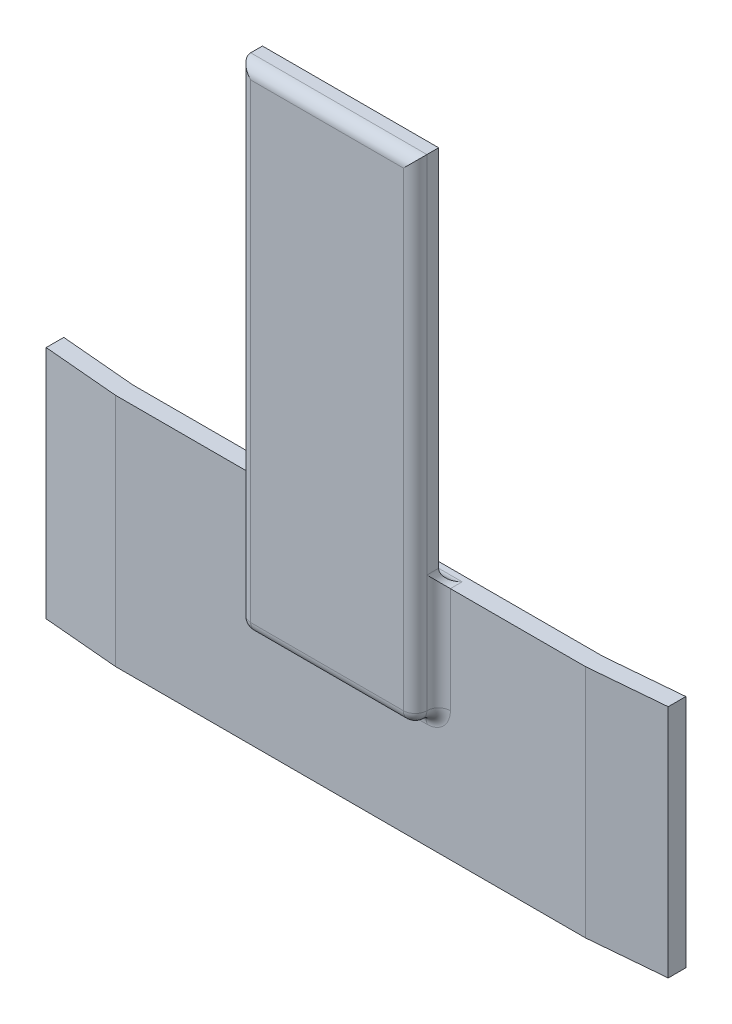
ISO-10303-21;
HEADER;
FILE_DESCRIPTION(('STEP AP214'),'2;1');
FILE_NAME('part.step','',(''),(''),'','','');
FILE_SCHEMA(('AUTOMOTIVE_DESIGN { 1 0 10303 214 1 1 1 1 }'));
ENDSEC;
DATA;
#1=APPLICATION_CONTEXT('core data for automotive mechanical design processes');
#2=APPLICATION_PROTOCOL_DEFINITION('international standard','automotive_design',2000,#1);
#3=PRODUCT_CONTEXT('',#1,'mechanical');
#4=PRODUCT('Part','Part','',(#3));
#5=PRODUCT_RELATED_PRODUCT_CATEGORY('part','',(#4));
#6=PRODUCT_DEFINITION_FORMATION('','',#4);
#7=PRODUCT_DEFINITION_CONTEXT('part definition',#1,'design');
#8=PRODUCT_DEFINITION('design','',#6,#7);
#9=PRODUCT_DEFINITION_SHAPE('','',#8);
#10=(LENGTH_UNIT() NAMED_UNIT(*) SI_UNIT(.MILLI.,.METRE.));
#11=(NAMED_UNIT(*) PLANE_ANGLE_UNIT() SI_UNIT($,.RADIAN.));
#12=(NAMED_UNIT(*) SI_UNIT($,.STERADIAN.) SOLID_ANGLE_UNIT());
#13=UNCERTAINTY_MEASURE_WITH_UNIT(LENGTH_MEASURE(1.E-05),#10,'distance_accuracy_value','');
#14=(GEOMETRIC_REPRESENTATION_CONTEXT(3) GLOBAL_UNCERTAINTY_ASSIGNED_CONTEXT((#13)) GLOBAL_UNIT_ASSIGNED_CONTEXT((#10,
#11,#12)) REPRESENTATION_CONTEXT('',''));
#15=CARTESIAN_POINT('',(0.,0.,0.));
#16=DIRECTION('',(0.,0.,1.));
#17=DIRECTION('',(1.,0.,0.));
#18=AXIS2_PLACEMENT_3D('',#15,#16,#17);
#19=CARTESIAN_POINT('',(0.,0.,3.81));
#20=DIRECTION('',(0.,0.,-1.));
#21=DIRECTION('',(-1.,0.,0.));
#22=AXIS2_PLACEMENT_3D('',#19,#20,#21);
#23=PLANE('',#22);
#24=CARTESIAN_POINT('',(-16.51,2.54,3.81));
#25=DIRECTION('',(0.,0.,-1.));
#26=DIRECTION('',(-1.,0.,0.));
#27=AXIS2_PLACEMENT_3D('',#24,#25,#26);
#28=CIRCLE('',#27,5.08);
#29=CARTESIAN_POINT('',(-21.59,2.54,3.81));
#30=VERTEX_POINT('',#29);
#31=CARTESIAN_POINT('',(-16.51,-2.54,3.81));
#32=VERTEX_POINT('',#31);
#33=EDGE_CURVE('E259',#30,#32,#28,.F.);
#34=ORIENTED_EDGE('',*,*,#33,.F.);
#35=DIRECTION('',(0.,-1.,0.));
#36=VECTOR('',#35,1.);
#37=CARTESIAN_POINT('',(-21.59,25.4,3.81));
#38=LINE('',#37,#36);
#39=CARTESIAN_POINT('',(-21.59,25.4,3.81));
#40=VERTEX_POINT('',#39);
#41=EDGE_CURVE('E277',#30,#40,#38,.F.);
#42=ORIENTED_EDGE('',*,*,#41,.T.);
#43=DIRECTION('',(1.,0.,0.));
#44=VECTOR('',#43,1.);
#45=CARTESIAN_POINT('',(-50.8,25.4,3.81));
#46=LINE('',#45,#44);
#47=CARTESIAN_POINT('',(-50.8,25.4,3.81));
#48=VERTEX_POINT('',#47);
#49=EDGE_CURVE('E251',#48,#40,#46,.T.);
#50=ORIENTED_EDGE('',*,*,#49,.F.);
#51=DIRECTION('',(0.,1.,0.));
#52=VECTOR('',#51,1.);
#53=CARTESIAN_POINT('',(-50.8,-25.4,3.81));
#54=LINE('',#53,#52);
#55=CARTESIAN_POINT('',(-50.8,-25.4,3.81));
#56=VERTEX_POINT('',#55);
#57=EDGE_CURVE('E246',#56,#48,#54,.T.);
#58=ORIENTED_EDGE('',*,*,#57,.F.);
#59=DIRECTION('',(1.,0.,0.));
#60=VECTOR('',#59,1.);
#61=CARTESIAN_POINT('',(-50.8,-25.4,3.81));
#62=LINE('',#61,#60);
#63=CARTESIAN_POINT('',(50.8,-25.4,3.81));
#64=VERTEX_POINT('',#63);
#65=EDGE_CURVE('E257',#56,#64,#62,.T.);
#66=ORIENTED_EDGE('',*,*,#65,.T.);
#67=DIRECTION('',(0.,1.,0.));
#68=VECTOR('',#67,1.);
#69=CARTESIAN_POINT('',(50.8,-25.4,3.81));
#70=LINE('',#69,#68);
#71=CARTESIAN_POINT('',(50.8,25.4,3.81));
#72=VERTEX_POINT('',#71);
#73=EDGE_CURVE('E254',#64,#72,#70,.T.);
#74=ORIENTED_EDGE('',*,*,#73,.T.);
#75=CARTESIAN_POINT('',(21.59,25.4,3.81));
#76=VERTEX_POINT('',#75);
#77=EDGE_CURVE('E249',#76,#72,#46,.T.);
#78=ORIENTED_EDGE('',*,*,#77,.F.);
#79=DIRECTION('',(0.,1.,0.));
#80=VECTOR('',#79,1.);
#81=CARTESIAN_POINT('',(21.59,0.,3.81));
#82=LINE('',#81,#80);
#83=CARTESIAN_POINT('',(21.59,2.54000000000001,3.81));
#84=VERTEX_POINT('',#83);
#85=EDGE_CURVE('E275',#76,#84,#82,.F.);
#86=ORIENTED_EDGE('',*,*,#85,.T.);
#87=CARTESIAN_POINT('',(16.51,2.54000000000001,3.81));
#88=DIRECTION('',(0.,0.,-1.));
#89=DIRECTION('',(-1.,0.,0.));
#90=AXIS2_PLACEMENT_3D('',#87,#88,#89);
#91=CIRCLE('',#90,5.08);
#92=CARTESIAN_POINT('',(16.51,-2.53999999999999,3.81));
#93=VERTEX_POINT('',#92);
#94=EDGE_CURVE('E272',#93,#84,#91,.F.);
#95=ORIENTED_EDGE('',*,*,#94,.F.);
#96=DIRECTION('',(1.,0.,0.));
#97=VECTOR('',#96,1.);
#98=CARTESIAN_POINT('',(-19.05,-2.54,3.81));
#99=LINE('',#98,#97);
#100=EDGE_CURVE('E270',#93,#32,#99,.F.);
#101=ORIENTED_EDGE('',*,*,#100,.T.);
#102=EDGE_LOOP('',(#34,#42,#50,#58,#66,#74,#78,#86,#95,#101));
#103=FACE_BOUND('',#102,.T.);
#104=ADVANCED_FACE('F35',(#103),#23,.F.);
#105=CARTESIAN_POINT('',(-50.8,-25.4,3.81));
#106=DIRECTION('',(0.,1.,0.));
#107=DIRECTION('',(0.,0.,1.));
#108=AXIS2_PLACEMENT_3D('',#105,#106,#107);
#109=PLANE('',#108);
#110=DIRECTION('',(1.,0.,0.));
#111=VECTOR('',#110,1.);
#112=CARTESIAN_POINT('',(-50.8,-25.4,0.));
#113=LINE('',#112,#111);
#114=CARTESIAN_POINT('',(-50.8,-25.4,0.));
#115=VERTEX_POINT('',#114);
#116=CARTESIAN_POINT('',(50.8,-25.4,0.));
#117=VERTEX_POINT('',#116);
#118=EDGE_CURVE('E250',#115,#117,#113,.T.);
#119=ORIENTED_EDGE('',*,*,#118,.T.);
#120=DIRECTION('',(0.996194698091746,0.,-0.0871557427476584));
#121=VECTOR('',#120,1.);
#122=CARTESIAN_POINT('',(50.8,-25.4,0.));
#123=LINE('',#122,#121);
#124=CARTESIAN_POINT('',(67.2471744654947,-25.4,-1.43894131276384));
#125=VERTEX_POINT('',#124);
#126=EDGE_CURVE('E231',#117,#125,#123,.T.);
#127=ORIENTED_EDGE('',*,*,#126,.T.);
#128=DIRECTION('',(0.,0.,1.));
#129=VECTOR('',#128,1.);
#130=CARTESIAN_POINT('',(67.2471744654947,-25.4,-1.43894131276384));
#131=LINE('',#130,#129);
#132=CARTESIAN_POINT('',(67.2471744654947,-25.4,2.37105868723616));
#133=VERTEX_POINT('',#132);
#134=EDGE_CURVE('E242',#125,#133,#131,.T.);
#135=ORIENTED_EDGE('',*,*,#134,.T.);
#136=DIRECTION('',(0.996194698091746,0.,-0.0871557427476584));
#137=VECTOR('',#136,1.);
#138=CARTESIAN_POINT('',(50.8,-25.4,3.81));
#139=LINE('',#138,#137);
#140=EDGE_CURVE('E228',#64,#133,#139,.T.);
#141=ORIENTED_EDGE('',*,*,#140,.F.);
#142=ORIENTED_EDGE('',*,*,#65,.F.);
#143=DIRECTION('',(-0.996194698091746,0.,-0.0871557427476584));
#144=VECTOR('',#143,1.);
#145=CARTESIAN_POINT('',(-50.8,-25.4,3.81));
#146=LINE('',#145,#144);
#147=CARTESIAN_POINT('',(-67.2471744654947,-25.4,2.37105868723616));
#148=VERTEX_POINT('',#147);
#149=EDGE_CURVE('E214',#56,#148,#146,.T.);
#150=ORIENTED_EDGE('',*,*,#149,.T.);
#151=DIRECTION('',(0.,0.,1.));
#152=VECTOR('',#151,1.);
#153=CARTESIAN_POINT('',(-67.2471744654947,-25.4,-1.43894131276384));
#154=LINE('',#153,#152);
#155=CARTESIAN_POINT('',(-67.2471744654947,-25.4,-1.43894131276384));
#156=VERTEX_POINT('',#155);
#157=EDGE_CURVE('E211',#156,#148,#154,.T.);
#158=ORIENTED_EDGE('',*,*,#157,.F.);
#159=DIRECTION('',(-0.996194698091746,0.,-0.0871557427476584));
#160=VECTOR('',#159,1.);
#161=CARTESIAN_POINT('',(-50.8,-25.4,0.));
#162=LINE('',#161,#160);
#163=EDGE_CURVE('E205',#115,#156,#162,.T.);
#164=ORIENTED_EDGE('',*,*,#163,.F.);
#165=EDGE_LOOP('',(#119,#127,#135,#141,#142,#150,#158,#164));
#166=FACE_BOUND('',#165,.T.);
#167=ADVANCED_FACE('F417',(#166),#109,.F.);
#168=CARTESIAN_POINT('',(-50.8,25.4,3.81));
#169=DIRECTION('',(0.,1.,0.));
#170=DIRECTION('',(0.,0.,1.));
#171=AXIS2_PLACEMENT_3D('',#168,#169,#170);
#172=PLANE('',#171);
#173=ORIENTED_EDGE('',*,*,#49,.T.);
#174=DIRECTION('',(0.,0.,1.));
#175=VECTOR('',#174,1.);
#176=CARTESIAN_POINT('',(-21.59,25.4,3.81));
#177=LINE('',#176,#175);
#178=CARTESIAN_POINT('',(-21.59,25.4,1.27));
#179=VERTEX_POINT('',#178);
#180=EDGE_CURVE('E348',#40,#179,#177,.F.);
#181=ORIENTED_EDGE('',*,*,#180,.T.);
#182=DIRECTION('',(1.,0.,0.));
#183=VECTOR('',#182,1.);
#184=CARTESIAN_POINT('',(-50.8,25.4,1.27));
#185=LINE('',#184,#183);
#186=CARTESIAN_POINT('',(21.59,25.4,1.27));
#187=VERTEX_POINT('',#186);
#188=EDGE_CURVE('E49',#179,#187,#185,.T.);
#189=ORIENTED_EDGE('',*,*,#188,.T.);
#190=DIRECTION('',(0.,0.,-1.));
#191=VECTOR('',#190,1.);
#192=CARTESIAN_POINT('',(21.59,25.4,3.81));
#193=LINE('',#192,#191);
#194=EDGE_CURVE('E339',#187,#76,#193,.F.);
#195=ORIENTED_EDGE('',*,*,#194,.T.);
#196=ORIENTED_EDGE('',*,*,#77,.T.);
#197=DIRECTION('',(-0.996194698091746,0.,0.0871557427476584));
#198=VECTOR('',#197,1.);
#199=CARTESIAN_POINT('',(67.2471744654947,25.4,2.37105868723616));
#200=LINE('',#199,#198);
#201=CARTESIAN_POINT('',(67.2471744654947,25.4,2.37105868723616));
#202=VERTEX_POINT('',#201);
#203=EDGE_CURVE('E237',#202,#72,#200,.T.);
#204=ORIENTED_EDGE('',*,*,#203,.F.);
#205=DIRECTION('',(0.,0.,1.));
#206=VECTOR('',#205,1.);
#207=CARTESIAN_POINT('',(67.2471744654947,25.4,-1.43894131276384));
#208=LINE('',#207,#206);
#209=CARTESIAN_POINT('',(67.2471744654947,25.4,-1.43894131276384));
#210=VERTEX_POINT('',#209);
#211=EDGE_CURVE('E234',#210,#202,#208,.T.);
#212=ORIENTED_EDGE('',*,*,#211,.F.);
#213=DIRECTION('',(-0.996194698091746,0.,0.0871557427476584));
#214=VECTOR('',#213,1.);
#215=CARTESIAN_POINT('',(67.2471744654947,25.4,-1.43894131276384));
#216=LINE('',#215,#214);
#217=CARTESIAN_POINT('',(50.8,25.4,0.));
#218=VERTEX_POINT('',#217);
#219=EDGE_CURVE('E227',#210,#218,#216,.T.);
#220=ORIENTED_EDGE('',*,*,#219,.T.);
#221=DIRECTION('',(1.,0.,0.));
#222=VECTOR('',#221,1.);
#223=CARTESIAN_POINT('',(-50.8,25.4,0.));
#224=LINE('',#223,#222);
#225=CARTESIAN_POINT('',(-50.8,25.4,0.));
#226=VERTEX_POINT('',#225);
#227=EDGE_CURVE('E261',#226,#218,#224,.T.);
#228=ORIENTED_EDGE('',*,*,#227,.F.);
#229=DIRECTION('',(0.996194698091746,0.,0.0871557427476584));
#230=VECTOR('',#229,1.);
#231=CARTESIAN_POINT('',(-67.2471744654947,25.4,-1.43894131276384));
#232=LINE('',#231,#230);
#233=CARTESIAN_POINT('',(-67.2471744654947,25.4,-1.43894131276384));
#234=VERTEX_POINT('',#233);
#235=EDGE_CURVE('E208',#234,#226,#232,.T.);
#236=ORIENTED_EDGE('',*,*,#235,.F.);
#237=DIRECTION('',(0.,0.,1.));
#238=VECTOR('',#237,1.);
#239=CARTESIAN_POINT('',(-67.2471744654947,25.4,-1.43894131276384));
#240=LINE('',#239,#238);
#241=CARTESIAN_POINT('',(-67.2471744654947,25.4,2.37105868723616));
#242=VERTEX_POINT('',#241);
#243=EDGE_CURVE('E218',#234,#242,#240,.T.);
#244=ORIENTED_EDGE('',*,*,#243,.T.);
#245=DIRECTION('',(0.996194698091746,0.,0.0871557427476584));
#246=VECTOR('',#245,1.);
#247=CARTESIAN_POINT('',(-67.2471744654947,25.4,2.37105868723616));
#248=LINE('',#247,#246);
#249=EDGE_CURVE('E206',#242,#48,#248,.T.);
#250=ORIENTED_EDGE('',*,*,#249,.T.);
#251=EDGE_LOOP('',(#173,#181,#189,#195,#196,#204,#212,#220,#228,#236,#244,#250));
#252=FACE_BOUND('',#251,.T.);
#253=ADVANCED_FACE('F360',(#252),#172,.T.);
#254=CARTESIAN_POINT('',(0.,0.,0.));
#255=DIRECTION('',(0.,0.,-1.));
#256=DIRECTION('',(-1.,0.,0.));
#257=AXIS2_PLACEMENT_3D('',#254,#255,#256);
#258=PLANE('',#257);
#259=DIRECTION('',(0.,1.,0.));
#260=VECTOR('',#259,1.);
#261=CARTESIAN_POINT('',(-50.8,-25.4,0.));
#262=LINE('',#261,#260);
#263=EDGE_CURVE('E244',#115,#226,#262,.T.);
#264=ORIENTED_EDGE('',*,*,#263,.T.);
#265=ORIENTED_EDGE('',*,*,#227,.T.);
#266=DIRECTION('',(0.,1.,0.));
#267=VECTOR('',#266,1.);
#268=CARTESIAN_POINT('',(50.8,-25.4,0.));
#269=LINE('',#268,#267);
#270=EDGE_CURVE('E263',#117,#218,#269,.T.);
#271=ORIENTED_EDGE('',*,*,#270,.F.);
#272=ORIENTED_EDGE('',*,*,#118,.F.);
#273=EDGE_LOOP('',(#264,#265,#271,#272));
#274=FACE_BOUND('',#273,.T.);
#275=ADVANCED_FACE('F428',(#274),#258,.T.);
#276=CARTESIAN_POINT('',(67.2471744654947,-25.4,-1.43894131276384));
#277=DIRECTION('',(1.,0.,0.));
#278=DIRECTION('',(0.,0.,-1.));
#279=AXIS2_PLACEMENT_3D('',#276,#277,#278);
#280=PLANE('',#279);
#281=DIRECTION('',(0.,1.,0.));
#282=VECTOR('',#281,1.);
#283=CARTESIAN_POINT('',(67.2471744654947,-25.4,2.37105868723616));
#284=LINE('',#283,#282);
#285=EDGE_CURVE('E221',#133,#202,#284,.T.);
#286=ORIENTED_EDGE('',*,*,#285,.F.);
#287=ORIENTED_EDGE('',*,*,#134,.F.);
#288=DIRECTION('',(0.,1.,0.));
#289=VECTOR('',#288,1.);
#290=CARTESIAN_POINT('',(67.2471744654947,-25.4,-1.43894131276384));
#291=LINE('',#290,#289);
#292=EDGE_CURVE('E224',#125,#210,#291,.T.);
#293=ORIENTED_EDGE('',*,*,#292,.T.);
#294=ORIENTED_EDGE('',*,*,#211,.T.);
#295=EDGE_LOOP('',(#286,#287,#293,#294));
#296=FACE_BOUND('',#295,.T.);
#297=ADVANCED_FACE('F426',(#296),#280,.T.);
#298=CARTESIAN_POINT('',(0.71668285194542,0.,4.3817224822283));
#299=DIRECTION('',(0.0871557427476584,0.,0.996194698091746));
#300=DIRECTION('',(0.996194698091746,0.,-0.0871557427476584));
#301=AXIS2_PLACEMENT_3D('',#298,#299,#300);
#302=PLANE('',#301);
#303=ORIENTED_EDGE('',*,*,#292,.F.);
#304=ORIENTED_EDGE('',*,*,#126,.F.);
#305=ORIENTED_EDGE('',*,*,#270,.T.);
#306=ORIENTED_EDGE('',*,*,#219,.F.);
#307=EDGE_LOOP('',(#303,#304,#305,#306));
#308=FACE_BOUND('',#307,.T.);
#309=ADVANCED_FACE('F628',(#308),#302,.F.);
#310=CARTESIAN_POINT('',(0.71668285194542,0.,8.1917224822283));
#311=DIRECTION('',(0.0871557427476584,0.,0.996194698091746));
#312=DIRECTION('',(0.996194698091746,0.,-0.0871557427476584));
#313=AXIS2_PLACEMENT_3D('',#310,#311,#312);
#314=PLANE('',#313);
#315=ORIENTED_EDGE('',*,*,#285,.T.);
#316=ORIENTED_EDGE('',*,*,#203,.T.);
#317=ORIENTED_EDGE('',*,*,#73,.F.);
#318=ORIENTED_EDGE('',*,*,#140,.T.);
#319=EDGE_LOOP('',(#315,#316,#317,#318));
#320=FACE_BOUND('',#319,.T.);
#321=ADVANCED_FACE('F599',(#320),#314,.T.);
#322=CARTESIAN_POINT('',(-67.2471744654947,-25.4,-1.43894131276384));
#323=DIRECTION('',(1.,0.,0.));
#324=DIRECTION('',(0.,0.,-1.));
#325=AXIS2_PLACEMENT_3D('',#322,#323,#324);
#326=PLANE('',#325);
#327=DIRECTION('',(0.,1.,0.));
#328=VECTOR('',#327,1.);
#329=CARTESIAN_POINT('',(-67.2471744654947,-25.4,2.37105868723616));
#330=LINE('',#329,#328);
#331=EDGE_CURVE('E178',#148,#242,#330,.T.);
#332=ORIENTED_EDGE('',*,*,#331,.T.);
#333=ORIENTED_EDGE('',*,*,#243,.F.);
#334=DIRECTION('',(0.,1.,0.));
#335=VECTOR('',#334,1.);
#336=CARTESIAN_POINT('',(-67.2471744654947,-25.4,-1.43894131276384));
#337=LINE('',#336,#335);
#338=EDGE_CURVE('E202',#156,#234,#337,.T.);
#339=ORIENTED_EDGE('',*,*,#338,.F.);
#340=ORIENTED_EDGE('',*,*,#157,.T.);
#341=EDGE_LOOP('',(#332,#333,#339,#340));
#342=FACE_BOUND('',#341,.T.);
#343=ADVANCED_FACE('F590',(#342),#326,.F.);
#344=CARTESIAN_POINT('',(-0.71668285194542,0.,4.3817224822283));
#345=DIRECTION('',(-0.0871557427476584,0.,0.996194698091746));
#346=DIRECTION('',(-0.996194698091746,0.,-0.0871557427476584));
#347=AXIS2_PLACEMENT_3D('',#344,#345,#346);
#348=PLANE('',#347);
#349=ORIENTED_EDGE('',*,*,#338,.T.);
#350=ORIENTED_EDGE('',*,*,#235,.T.);
#351=ORIENTED_EDGE('',*,*,#263,.F.);
#352=ORIENTED_EDGE('',*,*,#163,.T.);
#353=EDGE_LOOP('',(#349,#350,#351,#352));
#354=FACE_BOUND('',#353,.T.);
#355=ADVANCED_FACE('F581',(#354),#348,.F.);
#356=CARTESIAN_POINT('',(-0.71668285194542,0.,8.1917224822283));
#357=DIRECTION('',(-0.0871557427476584,0.,0.996194698091746));
#358=DIRECTION('',(-0.996194698091746,0.,-0.0871557427476584));
#359=AXIS2_PLACEMENT_3D('',#356,#357,#358);
#360=PLANE('',#359);
#361=ORIENTED_EDGE('',*,*,#331,.F.);
#362=ORIENTED_EDGE('',*,*,#149,.F.);
#363=ORIENTED_EDGE('',*,*,#57,.T.);
#364=ORIENTED_EDGE('',*,*,#249,.F.);
#365=EDGE_LOOP('',(#361,#362,#363,#364));
#366=FACE_BOUND('',#365,.T.);
#367=ADVANCED_FACE('F569',(#366),#360,.T.);
#368=CARTESIAN_POINT('',(19.05,106.68,8.89));
#369=DIRECTION('',(0.,-1.,0.));
#370=DIRECTION('',(1.,0.,0.));
#371=AXIS2_PLACEMENT_3D('',#368,#369,#370);
#372=PLANE('',#371);
#373=DIRECTION('',(0.,0.,-1.));
#374=VECTOR('',#373,1.);
#375=CARTESIAN_POINT('',(-19.05,106.68,8.89));
#376=LINE('',#375,#374);
#377=CARTESIAN_POINT('',(-19.05,106.68,6.35));
#378=VERTEX_POINT('',#377);
#379=CARTESIAN_POINT('',(-19.05,106.68,3.81));
#380=VERTEX_POINT('',#379);
#381=EDGE_CURVE('E167',#378,#380,#376,.T.);
#382=ORIENTED_EDGE('',*,*,#381,.F.);
#383=DIRECTION('',(-1.,0.,0.));
#384=VECTOR('',#383,1.);
#385=CARTESIAN_POINT('',(19.05,106.68,6.35));
#386=LINE('',#385,#384);
#387=CARTESIAN_POINT('',(19.05,106.68,6.35));
#388=VERTEX_POINT('',#387);
#389=EDGE_CURVE('E293',#378,#388,#386,.F.);
#390=ORIENTED_EDGE('',*,*,#389,.T.);
#391=DIRECTION('',(0.,0.,-1.));
#392=VECTOR('',#391,1.);
#393=CARTESIAN_POINT('',(19.05,106.68,8.89));
#394=LINE('',#393,#392);
#395=CARTESIAN_POINT('',(19.05,106.68,3.81));
#396=VERTEX_POINT('',#395);
#397=EDGE_CURVE('E179',#388,#396,#394,.T.);
#398=ORIENTED_EDGE('',*,*,#397,.T.);
#399=DIRECTION('',(-1.,0.,0.));
#400=VECTOR('',#399,1.);
#401=CARTESIAN_POINT('',(19.05,106.68,3.81));
#402=LINE('',#401,#400);
#403=EDGE_CURVE('E186',#396,#380,#402,.T.);
#404=ORIENTED_EDGE('',*,*,#403,.T.);
#405=EDGE_LOOP('',(#382,#390,#398,#404));
#406=FACE_BOUND('',#405,.T.);
#407=ADVANCED_FACE('F192',(#406),#372,.F.);
#408=CARTESIAN_POINT('',(-19.05,106.68,8.89));
#409=DIRECTION('',(1.,0.,0.));
#410=DIRECTION('',(0.,1.,0.));
#411=AXIS2_PLACEMENT_3D('',#408,#409,#410);
#412=PLANE('',#411);
#413=DIRECTION('',(0.,-1.,0.));
#414=VECTOR('',#413,1.);
#415=CARTESIAN_POINT('',(-19.05,106.68,3.81));
#416=LINE('',#415,#414);
#417=CARTESIAN_POINT('',(-19.05,27.94,3.81));
#418=VERTEX_POINT('',#417);
#419=EDGE_CURVE('E171',#380,#418,#416,.T.);
#420=ORIENTED_EDGE('',*,*,#419,.T.);
#421=DIRECTION('',(0.,0.,1.));
#422=VECTOR('',#421,1.);
#423=CARTESIAN_POINT('',(-19.05,27.94,8.89));
#424=LINE('',#423,#422);
#425=CARTESIAN_POINT('',(-19.05,27.94,6.35));
#426=VERTEX_POINT('',#425);
#427=EDGE_CURVE('E346',#418,#426,#424,.T.);
#428=ORIENTED_EDGE('',*,*,#427,.T.);
#429=DIRECTION('',(0.,-1.,0.));
#430=VECTOR('',#429,1.);
#431=CARTESIAN_POINT('',(-19.05,106.68,6.35));
#432=LINE('',#431,#430);
#433=EDGE_CURVE('E174',#426,#378,#432,.F.);
#434=ORIENTED_EDGE('',*,*,#433,.T.);
#435=ORIENTED_EDGE('',*,*,#381,.T.);
#436=EDGE_LOOP('',(#420,#428,#434,#435));
#437=FACE_BOUND('',#436,.T.);
#438=ADVANCED_FACE('F169',(#437),#412,.F.);
#439=CARTESIAN_POINT('',(19.05,0.,8.89));
#440=DIRECTION('',(-1.,0.,0.));
#441=DIRECTION('',(0.,-1.,0.));
#442=AXIS2_PLACEMENT_3D('',#439,#440,#441);
#443=PLANE('',#442);
#444=DIRECTION('',(0.,1.,0.));
#445=VECTOR('',#444,1.);
#446=CARTESIAN_POINT('',(19.05,0.,6.35));
#447=LINE('',#446,#445);
#448=CARTESIAN_POINT('',(19.05,27.94,6.35));
#449=VERTEX_POINT('',#448);
#450=EDGE_CURVE('E281',#388,#449,#447,.F.);
#451=ORIENTED_EDGE('',*,*,#450,.T.);
#452=DIRECTION('',(0.,0.,-1.));
#453=VECTOR('',#452,1.);
#454=CARTESIAN_POINT('',(19.05,27.94,8.89));
#455=LINE('',#454,#453);
#456=CARTESIAN_POINT('',(19.05,27.94,3.81));
#457=VERTEX_POINT('',#456);
#458=EDGE_CURVE('E336',#449,#457,#455,.T.);
#459=ORIENTED_EDGE('',*,*,#458,.T.);
#460=DIRECTION('',(0.,1.,0.));
#461=VECTOR('',#460,1.);
#462=CARTESIAN_POINT('',(19.05,0.,3.81));
#463=LINE('',#462,#461);
#464=EDGE_CURVE('E189',#457,#396,#463,.T.);
#465=ORIENTED_EDGE('',*,*,#464,.T.);
#466=ORIENTED_EDGE('',*,*,#397,.F.);
#467=EDGE_LOOP('',(#451,#459,#465,#466));
#468=FACE_BOUND('',#467,.T.);
#469=ADVANCED_FACE('F397',(#468),#443,.F.);
#470=CARTESIAN_POINT('',(0.,0.,8.89));
#471=DIRECTION('',(0.,0.,1.));
#472=DIRECTION('',(1.,0.,0.));
#473=AXIS2_PLACEMENT_3D('',#470,#471,#472);
#474=PLANE('',#473);
#475=DIRECTION('',(1.,0.,0.));
#476=VECTOR('',#475,1.);
#477=CARTESIAN_POINT('',(19.05,2.54000000000001,8.89));
#478=LINE('',#477,#476);
#479=CARTESIAN_POINT('',(-16.51,2.54,8.89));
#480=VERTEX_POINT('',#479);
#481=CARTESIAN_POINT('',(16.51,2.54000000000001,8.89));
#482=VERTEX_POINT('',#481);
#483=EDGE_CURVE('E288',#480,#482,#478,.T.);
#484=ORIENTED_EDGE('',*,*,#483,.T.);
#485=DIRECTION('',(0.,1.,0.));
#486=VECTOR('',#485,1.);
#487=CARTESIAN_POINT('',(16.51,106.68,8.89));
#488=LINE('',#487,#486);
#489=CARTESIAN_POINT('',(16.51,104.14,8.89));
#490=VERTEX_POINT('',#489);
#491=EDGE_CURVE('E290',#482,#490,#488,.T.);
#492=ORIENTED_EDGE('',*,*,#491,.T.);
#493=DIRECTION('',(-1.,0.,0.));
#494=VECTOR('',#493,1.);
#495=CARTESIAN_POINT('',(-19.05,104.14,8.89));
#496=LINE('',#495,#494);
#497=CARTESIAN_POINT('',(-16.51,104.14,8.89));
#498=VERTEX_POINT('',#497);
#499=EDGE_CURVE('E284',#490,#498,#496,.T.);
#500=ORIENTED_EDGE('',*,*,#499,.T.);
#501=DIRECTION('',(0.,-1.,0.));
#502=VECTOR('',#501,1.);
#503=CARTESIAN_POINT('',(-16.51,0.,8.89));
#504=LINE('',#503,#502);
#505=EDGE_CURVE('E286',#498,#480,#504,.T.);
#506=ORIENTED_EDGE('',*,*,#505,.T.);
#507=EDGE_LOOP('',(#484,#492,#500,#506));
#508=FACE_BOUND('',#507,.T.);
#509=ADVANCED_FACE('F540',(#508),#474,.T.);
#510=CARTESIAN_POINT('',(0.,0.,3.81));
#511=DIRECTION('',(0.,0.,1.));
#512=DIRECTION('',(1.,0.,0.));
#513=AXIS2_PLACEMENT_3D('',#510,#511,#512);
#514=PLANE('',#513);
#515=ORIENTED_EDGE('',*,*,#464,.F.);
#516=DIRECTION('',(1.,0.,0.));
#517=VECTOR('',#516,1.);
#518=CARTESIAN_POINT('',(0.,27.94,3.81));
#519=LINE('',#518,#517);
#520=EDGE_CURVE('E188',#457,#418,#519,.F.);
#521=ORIENTED_EDGE('',*,*,#520,.T.);
#522=ORIENTED_EDGE('',*,*,#419,.F.);
#523=ORIENTED_EDGE('',*,*,#403,.F.);
#524=EDGE_LOOP('',(#515,#521,#522,#523));
#525=FACE_BOUND('',#524,.T.);
#526=ADVANCED_FACE('F185',(#525),#514,.F.);
#527=CARTESIAN_POINT('',(16.51,2.54000000000001,6.35));
#528=DIRECTION('',(0.,0.,1.));
#529=DIRECTION('',(1.,0.,0.));
#530=AXIS2_PLACEMENT_3D('',#527,#528,#529);
#531=SPHERICAL_SURFACE('',#530,2.54);
#532=CARTESIAN_POINT('',(16.51,2.54000000000001,6.35));
#533=DIRECTION('',(0.,0.,1.));
#534=DIRECTION('',(1.,0.,0.));
#535=AXIS2_PLACEMENT_3D('',#532,#533,#534);
#536=CIRCLE('',#535,2.54);
#537=CARTESIAN_POINT('',(19.05,2.54000000000001,6.35));
#538=VERTEX_POINT('',#537);
#539=CARTESIAN_POINT('',(16.51,0.,6.35));
#540=VERTEX_POINT('',#539);
#541=EDGE_CURVE('E194',#538,#540,#536,.F.);
#542=ORIENTED_EDGE('',*,*,#541,.F.);
#543=CARTESIAN_POINT('',(16.51,2.54000000000001,6.35));
#544=DIRECTION('',(0.,-1.,0.));
#545=DIRECTION('',(1.,0.,0.));
#546=AXIS2_PLACEMENT_3D('',#543,#544,#545);
#547=CIRCLE('',#546,2.54);
#548=EDGE_CURVE('E330',#482,#538,#547,.F.);
#549=ORIENTED_EDGE('',*,*,#548,.F.);
#550=CARTESIAN_POINT('',(16.51,2.54000000000001,6.35));
#551=DIRECTION('',(1.,0.,0.));
#552=DIRECTION('',(0.,0.,-1.));
#553=AXIS2_PLACEMENT_3D('',#550,#551,#552);
#554=CIRCLE('',#553,2.54);
#555=EDGE_CURVE('E327',#540,#482,#554,.F.);
#556=ORIENTED_EDGE('',*,*,#555,.F.);
#557=EDGE_LOOP('',(#542,#549,#556));
#558=FACE_BOUND('',#557,.T.);
#559=ADVANCED_FACE('F403',(#558),#531,.T.);
#560=CARTESIAN_POINT('',(21.59,0.,6.35));
#561=DIRECTION('',(0.,-1.,0.));
#562=DIRECTION('',(1.,0.,0.));
#563=AXIS2_PLACEMENT_3D('',#560,#561,#562);
#564=CYLINDRICAL_SURFACE('',#563,2.54);
#565=ORIENTED_EDGE('',*,*,#85,.F.);
#566=CARTESIAN_POINT('',(21.59,27.94,6.35));
#567=DIRECTION('',(0.,-0.707106781186547,0.707106781186547));
#568=DIRECTION('',(0.,-0.707106781186547,-0.707106781186547));
#569=AXIS2_PLACEMENT_3D('',#566,#567,#568);
#570=ELLIPSE('',#569,3.59210244842766,2.54);
#571=EDGE_CURVE('E343',#76,#449,#570,.F.);
#572=ORIENTED_EDGE('',*,*,#571,.T.);
#573=DIRECTION('',(0.,1.,0.));
#574=VECTOR('',#573,1.);
#575=CARTESIAN_POINT('',(19.05,25.4,6.35));
#576=LINE('',#575,#574);
#577=EDGE_CURVE('E197',#538,#449,#576,.T.);
#578=ORIENTED_EDGE('',*,*,#577,.F.);
#579=CARTESIAN_POINT('',(21.59,2.54000000000001,6.35));
#580=DIRECTION('',(0.,1.,0.));
#581=DIRECTION('',(-1.,0.,0.));
#582=AXIS2_PLACEMENT_3D('',#579,#580,#581);
#583=CIRCLE('',#582,2.54);
#584=EDGE_CURVE('E324',#84,#538,#583,.T.);
#585=ORIENTED_EDGE('',*,*,#584,.F.);
#586=EDGE_LOOP('',(#565,#572,#578,#585));
#587=FACE_BOUND('',#586,.T.);
#588=ADVANCED_FACE('F374',(#587),#564,.F.);
#589=CARTESIAN_POINT('',(16.51,0.,6.35));
#590=DIRECTION('',(0.,-1.,0.));
#591=DIRECTION('',(1.,0.,0.));
#592=AXIS2_PLACEMENT_3D('',#589,#590,#591);
#593=CYLINDRICAL_SURFACE('',#592,2.54);
#594=ORIENTED_EDGE('',*,*,#577,.T.);
#595=ORIENTED_EDGE('',*,*,#450,.F.);
#596=CARTESIAN_POINT('',(16.51,104.14,6.35));
#597=DIRECTION('',(0.707106781186548,-0.707106781186547,0.));
#598=DIRECTION('',(0.707106781186547,0.707106781186548,0.));
#599=AXIS2_PLACEMENT_3D('',#596,#597,#598);
#600=ELLIPSE('',#599,3.59210244842766,2.54);
#601=EDGE_CURVE('E321',#490,#388,#600,.F.);
#602=ORIENTED_EDGE('',*,*,#601,.F.);
#603=ORIENTED_EDGE('',*,*,#491,.F.);
#604=ORIENTED_EDGE('',*,*,#548,.T.);
#605=EDGE_LOOP('',(#594,#595,#602,#603,#604));
#606=FACE_BOUND('',#605,.T.);
#607=ADVANCED_FACE('F399',(#606),#593,.T.);
#608=CARTESIAN_POINT('',(0.,2.54,6.35));
#609=DIRECTION('',(-1.,0.,0.));
#610=DIRECTION('',(0.,-1.,0.));
#611=AXIS2_PLACEMENT_3D('',#608,#609,#610);
#612=CYLINDRICAL_SURFACE('',#611,2.54);
#613=ORIENTED_EDGE('',*,*,#555,.T.);
#614=ORIENTED_EDGE('',*,*,#483,.F.);
#615=CARTESIAN_POINT('',(-16.51,2.54,6.35));
#616=DIRECTION('',(-1.,0.,0.));
#617=DIRECTION('',(0.,0.,1.));
#618=AXIS2_PLACEMENT_3D('',#615,#616,#617);
#619=CIRCLE('',#618,2.54);
#620=CARTESIAN_POINT('',(-16.51,0.,6.35));
#621=VERTEX_POINT('',#620);
#622=EDGE_CURVE('E318',#621,#480,#619,.T.);
#623=ORIENTED_EDGE('',*,*,#622,.F.);
#624=DIRECTION('',(1.,0.,0.));
#625=VECTOR('',#624,1.);
#626=CARTESIAN_POINT('',(-19.05,0.,6.35));
#627=LINE('',#626,#625);
#628=EDGE_CURVE('E312',#540,#621,#627,.F.);
#629=ORIENTED_EDGE('',*,*,#628,.F.);
#630=EDGE_LOOP('',(#613,#614,#623,#629));
#631=FACE_BOUND('',#630,.T.);
#632=ADVANCED_FACE('F405',(#631),#612,.T.);
#633=CARTESIAN_POINT('',(16.51,2.54000000000001,6.35));
#634=DIRECTION('',(0.,0.,-1.));
#635=DIRECTION('',(-1.,0.,0.));
#636=AXIS2_PLACEMENT_3D('',#633,#634,#635);
#637=TOROIDAL_SURFACE('',#636,5.08,2.54);
#638=ORIENTED_EDGE('',*,*,#584,.T.);
#639=ORIENTED_EDGE('',*,*,#541,.T.);
#640=CARTESIAN_POINT('',(16.51,-2.53999999999999,6.35));
#641=DIRECTION('',(-1.,0.,0.));
#642=DIRECTION('',(0.,0.,1.));
#643=AXIS2_PLACEMENT_3D('',#640,#641,#642);
#644=CIRCLE('',#643,2.54);
#645=EDGE_CURVE('E309',#93,#540,#644,.F.);
#646=ORIENTED_EDGE('',*,*,#645,.F.);
#647=ORIENTED_EDGE('',*,*,#94,.T.);
#648=EDGE_LOOP('',(#638,#639,#646,#647));
#649=FACE_BOUND('',#648,.T.);
#650=ADVANCED_FACE('F378',(#649),#637,.F.);
#651=CARTESIAN_POINT('',(0.,104.14,6.35));
#652=DIRECTION('',(1.,0.,0.));
#653=DIRECTION('',(0.,1.,0.));
#654=AXIS2_PLACEMENT_3D('',#651,#652,#653);
#655=CYLINDRICAL_SURFACE('',#654,2.54);
#656=ORIENTED_EDGE('',*,*,#601,.T.);
#657=ORIENTED_EDGE('',*,*,#389,.F.);
#658=CARTESIAN_POINT('',(-16.51,104.14,6.35));
#659=DIRECTION('',(0.707106781186547,0.707106781186548,0.));
#660=DIRECTION('',(0.707106781186548,-0.707106781186547,0.));
#661=AXIS2_PLACEMENT_3D('',#658,#659,#660);
#662=ELLIPSE('',#661,3.59210244842766,2.54);
#663=EDGE_CURVE('E306',#498,#378,#662,.F.);
#664=ORIENTED_EDGE('',*,*,#663,.F.);
#665=ORIENTED_EDGE('',*,*,#499,.F.);
#666=EDGE_LOOP('',(#656,#657,#664,#665));
#667=FACE_BOUND('',#666,.T.);
#668=ADVANCED_FACE('F393',(#667),#655,.T.);
#669=CARTESIAN_POINT('',(-16.51,2.54,6.35));
#670=DIRECTION('',(0.,0.,1.));
#671=DIRECTION('',(1.,0.,0.));
#672=AXIS2_PLACEMENT_3D('',#669,#670,#671);
#673=SPHERICAL_SURFACE('',#672,2.54);
#674=CARTESIAN_POINT('',(-16.51,2.54,6.35));
#675=DIRECTION('',(0.,0.,1.));
#676=DIRECTION('',(1.,0.,0.));
#677=AXIS2_PLACEMENT_3D('',#674,#675,#676);
#678=CIRCLE('',#677,2.54);
#679=CARTESIAN_POINT('',(-19.05,2.54,6.35));
#680=VERTEX_POINT('',#679);
#681=EDGE_CURVE('E315',#621,#680,#678,.F.);
#682=ORIENTED_EDGE('',*,*,#681,.F.);
#683=ORIENTED_EDGE('',*,*,#622,.T.);
#684=CARTESIAN_POINT('',(-16.51,2.54,6.35));
#685=DIRECTION('',(0.,-1.,0.));
#686=DIRECTION('',(1.,0.,0.));
#687=AXIS2_PLACEMENT_3D('',#684,#685,#686);
#688=CIRCLE('',#687,2.54);
#689=EDGE_CURVE('E303',#680,#480,#688,.F.);
#690=ORIENTED_EDGE('',*,*,#689,.F.);
#691=EDGE_LOOP('',(#682,#683,#690));
#692=FACE_BOUND('',#691,.T.);
#693=ADVANCED_FACE('F407',(#692),#673,.T.);
#694=CARTESIAN_POINT('',(-19.05,-2.54,6.35));
#695=DIRECTION('',(-1.,0.,0.));
#696=DIRECTION('',(0.,-1.,0.));
#697=AXIS2_PLACEMENT_3D('',#694,#695,#696);
#698=CYLINDRICAL_SURFACE('',#697,2.54);
#699=ORIENTED_EDGE('',*,*,#645,.T.);
#700=ORIENTED_EDGE('',*,*,#628,.T.);
#701=CARTESIAN_POINT('',(-16.51,-2.54,6.35));
#702=DIRECTION('',(1.,0.,0.));
#703=DIRECTION('',(0.,0.,-1.));
#704=AXIS2_PLACEMENT_3D('',#701,#702,#703);
#705=CIRCLE('',#704,2.54);
#706=EDGE_CURVE('E300',#32,#621,#705,.T.);
#707=ORIENTED_EDGE('',*,*,#706,.F.);
#708=ORIENTED_EDGE('',*,*,#100,.F.);
#709=EDGE_LOOP('',(#699,#700,#707,#708));
#710=FACE_BOUND('',#709,.T.);
#711=ADVANCED_FACE('F382',(#710),#698,.F.);
#712=CARTESIAN_POINT('',(-16.51,0.,6.35));
#713=DIRECTION('',(0.,1.,0.));
#714=DIRECTION('',(-1.,0.,0.));
#715=AXIS2_PLACEMENT_3D('',#712,#713,#714);
#716=CYLINDRICAL_SURFACE('',#715,2.54);
#717=ORIENTED_EDGE('',*,*,#663,.T.);
#718=ORIENTED_EDGE('',*,*,#433,.F.);
#719=DIRECTION('',(0.,-1.,0.));
#720=VECTOR('',#719,1.);
#721=CARTESIAN_POINT('',(-19.05,106.68,6.35));
#722=LINE('',#721,#720);
#723=EDGE_CURVE('E298',#680,#426,#722,.F.);
#724=ORIENTED_EDGE('',*,*,#723,.F.);
#725=ORIENTED_EDGE('',*,*,#689,.T.);
#726=ORIENTED_EDGE('',*,*,#505,.F.);
#727=EDGE_LOOP('',(#717,#718,#724,#725,#726));
#728=FACE_BOUND('',#727,.T.);
#729=ADVANCED_FACE('F389',(#728),#716,.T.);
#730=CARTESIAN_POINT('',(-16.51,2.54,6.35));
#731=DIRECTION('',(0.,0.,-1.));
#732=DIRECTION('',(-1.,0.,0.));
#733=AXIS2_PLACEMENT_3D('',#730,#731,#732);
#734=TOROIDAL_SURFACE('',#733,5.08,2.54);
#735=ORIENTED_EDGE('',*,*,#706,.T.);
#736=ORIENTED_EDGE('',*,*,#681,.T.);
#737=CARTESIAN_POINT('',(-21.59,2.54,6.35));
#738=DIRECTION('',(0.,1.,0.));
#739=DIRECTION('',(-1.,0.,0.));
#740=AXIS2_PLACEMENT_3D('',#737,#738,#739);
#741=CIRCLE('',#740,2.54);
#742=EDGE_CURVE('E295',#30,#680,#741,.F.);
#743=ORIENTED_EDGE('',*,*,#742,.F.);
#744=ORIENTED_EDGE('',*,*,#33,.T.);
#745=EDGE_LOOP('',(#735,#736,#743,#744));
#746=FACE_BOUND('',#745,.T.);
#747=ADVANCED_FACE('F385',(#746),#734,.F.);
#748=CARTESIAN_POINT('',(-21.59,106.68,6.35));
#749=DIRECTION('',(0.,1.,0.));
#750=DIRECTION('',(-1.,0.,0.));
#751=AXIS2_PLACEMENT_3D('',#748,#749,#750);
#752=CYLINDRICAL_SURFACE('',#751,2.54);
#753=ORIENTED_EDGE('',*,*,#723,.T.);
#754=CARTESIAN_POINT('',(-21.59,27.94,6.35));
#755=DIRECTION('',(0.,0.707106781186547,-0.707106781186547));
#756=DIRECTION('',(0.,0.707106781186547,0.707106781186547));
#757=AXIS2_PLACEMENT_3D('',#754,#755,#756);
#758=ELLIPSE('',#757,3.59210244842766,2.54);
#759=EDGE_CURVE('E44',#426,#40,#758,.T.);
#760=ORIENTED_EDGE('',*,*,#759,.T.);
#761=ORIENTED_EDGE('',*,*,#41,.F.);
#762=ORIENTED_EDGE('',*,*,#742,.T.);
#763=EDGE_LOOP('',(#753,#760,#761,#762));
#764=FACE_BOUND('',#763,.T.);
#765=ADVANCED_FACE('F352',(#764),#752,.F.);
#766=CARTESIAN_POINT('',(-50.8,27.94,1.27));
#767=DIRECTION('',(1.,0.,0.));
#768=DIRECTION('',(0.,0.,-1.));
#769=AXIS2_PLACEMENT_3D('',#766,#767,#768);
#770=CYLINDRICAL_SURFACE('',#769,2.54);
#771=ORIENTED_EDGE('',*,*,#188,.F.);
#772=CARTESIAN_POINT('',(-21.59,27.94,1.27));
#773=DIRECTION('',(0.707106781186547,0.,-0.707106781186547));
#774=DIRECTION('',(0.707106781186547,0.,0.707106781186547));
#775=AXIS2_PLACEMENT_3D('',#772,#773,#774);
#776=ELLIPSE('',#775,3.59210244842766,2.54);
#777=EDGE_CURVE('E11',#179,#418,#776,.F.);
#778=ORIENTED_EDGE('',*,*,#777,.T.);
#779=ORIENTED_EDGE('',*,*,#520,.F.);
#780=CARTESIAN_POINT('',(21.59,27.94,1.27));
#781=DIRECTION('',(0.707106781186547,0.,0.707106781186547));
#782=DIRECTION('',(0.707106781186547,0.,-0.707106781186547));
#783=AXIS2_PLACEMENT_3D('',#780,#781,#782);
#784=ELLIPSE('',#783,3.59210244842766,2.54);
#785=EDGE_CURVE('E341',#457,#187,#784,.T.);
#786=ORIENTED_EDGE('',*,*,#785,.T.);
#787=EDGE_LOOP('',(#771,#778,#779,#786));
#788=FACE_BOUND('',#787,.T.);
#789=ADVANCED_FACE('F362',(#788),#770,.F.);
#790=CARTESIAN_POINT('',(21.59,27.94,8.89));
#791=DIRECTION('',(0.,0.,-1.));
#792=DIRECTION('',(-1.,0.,0.));
#793=AXIS2_PLACEMENT_3D('',#790,#791,#792);
#794=CYLINDRICAL_SURFACE('',#793,2.54);
#795=ORIENTED_EDGE('',*,*,#571,.F.);
#796=ORIENTED_EDGE('',*,*,#194,.F.);
#797=ORIENTED_EDGE('',*,*,#785,.F.);
#798=ORIENTED_EDGE('',*,*,#458,.F.);
#799=EDGE_LOOP('',(#795,#796,#797,#798));
#800=FACE_BOUND('',#799,.T.);
#801=ADVANCED_FACE('F367',(#800),#794,.F.);
#802=CARTESIAN_POINT('',(-21.59,27.94,8.89));
#803=DIRECTION('',(0.,0.,1.));
#804=DIRECTION('',(1.,0.,0.));
#805=AXIS2_PLACEMENT_3D('',#802,#803,#804);
#806=CYLINDRICAL_SURFACE('',#805,2.54);
#807=ORIENTED_EDGE('',*,*,#777,.F.);
#808=ORIENTED_EDGE('',*,*,#180,.F.);
#809=ORIENTED_EDGE('',*,*,#759,.F.);
#810=ORIENTED_EDGE('',*,*,#427,.F.);
#811=EDGE_LOOP('',(#807,#808,#809,#810));
#812=FACE_BOUND('',#811,.T.);
#813=ADVANCED_FACE('F37',(#812),#806,.F.);
#814=CLOSED_SHELL('',(#104,#167,#253,#275,#297,#309,#321,#343,#355,#367,#407,#438,#469,#509,
#526,#559,#588,#607,#632,#650,#668,#693,#711,#729,#747,#765,#789,#801,#813));
#815=MANIFOLD_SOLID_BREP('B2',#814);
#816=ADVANCED_BREP_SHAPE_REPRESENTATION('',(#18,#815),#14);
#817=SHAPE_DEFINITION_REPRESENTATION(#9,#816);
ENDSEC;
END-ISO-10303-21;
